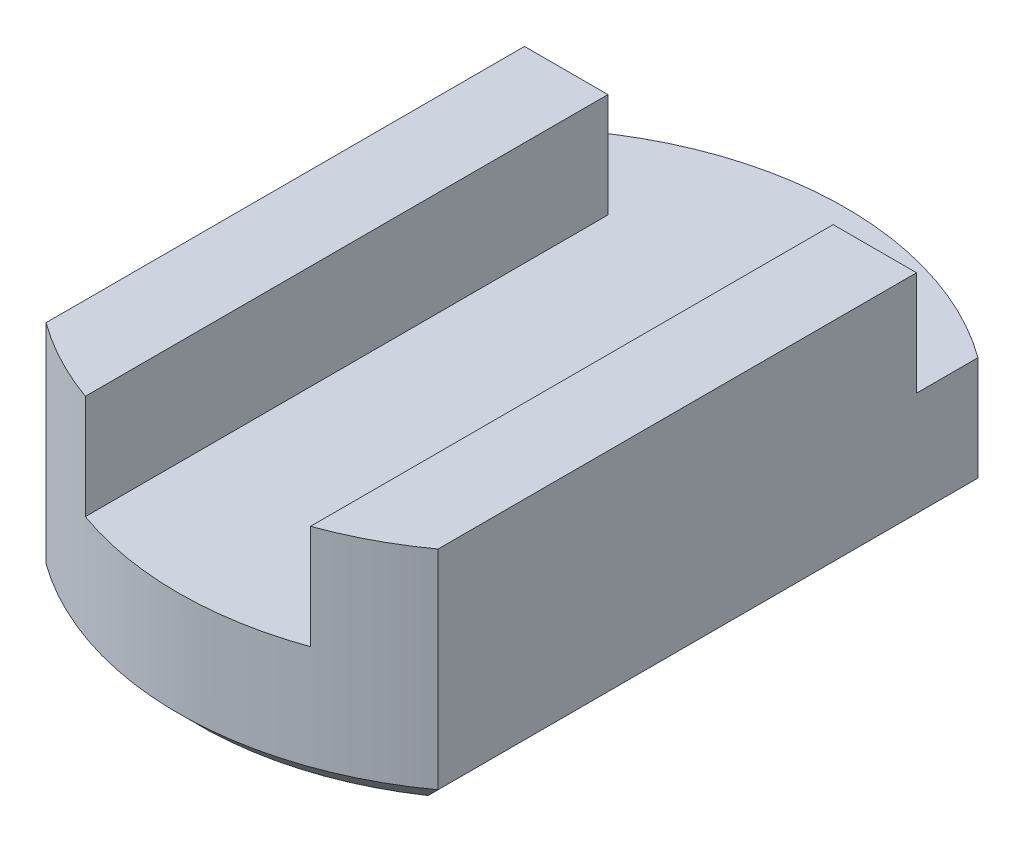
ISO-10303-21;
HEADER;
FILE_DESCRIPTION(('STEP AP214'),'2;1');
FILE_NAME('part.step','',(''),(''),'','','');
FILE_SCHEMA(('AUTOMOTIVE_DESIGN { 1 0 10303 214 1 1 1 1 }'));
ENDSEC;
DATA;
#1=APPLICATION_CONTEXT('core data for automotive mechanical design processes');
#2=APPLICATION_PROTOCOL_DEFINITION('international standard','automotive_design',2000,#1);
#3=PRODUCT_CONTEXT('',#1,'mechanical');
#4=PRODUCT('Part','Part','',(#3));
#5=PRODUCT_RELATED_PRODUCT_CATEGORY('part','',(#4));
#6=PRODUCT_DEFINITION_FORMATION('','',#4);
#7=PRODUCT_DEFINITION_CONTEXT('part definition',#1,'design');
#8=PRODUCT_DEFINITION('design','',#6,#7);
#9=PRODUCT_DEFINITION_SHAPE('','',#8);
#10=(LENGTH_UNIT() NAMED_UNIT(*) SI_UNIT(.MILLI.,.METRE.));
#11=(NAMED_UNIT(*) PLANE_ANGLE_UNIT() SI_UNIT($,.RADIAN.));
#12=(NAMED_UNIT(*) SI_UNIT($,.STERADIAN.) SOLID_ANGLE_UNIT());
#13=UNCERTAINTY_MEASURE_WITH_UNIT(LENGTH_MEASURE(1.E-05),#10,'distance_accuracy_value','');
#14=(GEOMETRIC_REPRESENTATION_CONTEXT(3) GLOBAL_UNCERTAINTY_ASSIGNED_CONTEXT((#13)) GLOBAL_UNIT_ASSIGNED_CONTEXT((#10,
#11,#12)) REPRESENTATION_CONTEXT('',''));
#15=CARTESIAN_POINT('',(0.,0.,0.));
#16=DIRECTION('',(0.,0.,1.));
#17=DIRECTION('',(1.,0.,0.));
#18=AXIS2_PLACEMENT_3D('',#15,#16,#17);
#19=CARTESIAN_POINT('',(0.,3.,0.));
#20=DIRECTION('',(0.,-1.,0.));
#21=DIRECTION('',(0.,0.,-1.));
#22=AXIS2_PLACEMENT_3D('',#19,#20,#21);
#23=CYLINDRICAL_SURFACE('',#22,8.);
#24=CARTESIAN_POINT('',(0.,3.,0.));
#25=DIRECTION('',(0.,1.,0.));
#26=DIRECTION('',(0.,0.,1.));
#27=AXIS2_PLACEMENT_3D('',#24,#25,#26);
#28=CIRCLE('',#27,8.);
#29=CARTESIAN_POINT('',(4.7,3.,-6.4737933238558));
#30=VERTEX_POINT('',#29);
#31=CARTESIAN_POINT('',(-4.7,3.,-6.47379332385581));
#32=VERTEX_POINT('',#31);
#33=EDGE_CURVE('E205',#30,#32,#28,.T.);
#34=ORIENTED_EDGE('',*,*,#33,.F.);
#35=DIRECTION('',(0.,-1.,0.));
#36=VECTOR('',#35,1.);
#37=CARTESIAN_POINT('',(4.7,3.,-6.4737933238558));
#38=LINE('',#37,#36);
#39=CARTESIAN_POINT('',(4.7,0.499999999999999,-6.4737933238558));
#40=VERTEX_POINT('',#39);
#41=EDGE_CURVE('E158',#30,#40,#38,.T.);
#42=ORIENTED_EDGE('',*,*,#41,.T.);
#43=CARTESIAN_POINT('',(0.,0.499999999999999,0.));
#44=DIRECTION('',(0.,1.,0.));
#45=DIRECTION('',(0.,0.,1.));
#46=AXIS2_PLACEMENT_3D('',#43,#44,#45);
#47=CIRCLE('',#46,8.);
#48=CARTESIAN_POINT('',(-4.7,0.499999999999999,-6.47379332385581));
#49=VERTEX_POINT('',#48);
#50=EDGE_CURVE('E242',#40,#49,#47,.T.);
#51=ORIENTED_EDGE('',*,*,#50,.T.);
#52=DIRECTION('',(0.,-1.,0.));
#53=VECTOR('',#52,1.);
#54=CARTESIAN_POINT('',(-4.7,3.,-6.47379332385581));
#55=LINE('',#54,#53);
#56=EDGE_CURVE('E209',#32,#49,#55,.T.);
#57=ORIENTED_EDGE('',*,*,#56,.F.);
#58=EDGE_LOOP('',(#34,#42,#51,#57));
#59=FACE_BOUND('',#58,.T.);
#60=ADVANCED_FACE('F43',(#59),#23,.T.);
#61=CARTESIAN_POINT('',(0.,3.,0.));
#62=DIRECTION('',(0.,1.,0.));
#63=DIRECTION('',(0.,0.,1.));
#64=AXIS2_PLACEMENT_3D('',#61,#62,#63);
#65=PLANE('',#64);
#66=DIRECTION('',(0.,0.,1.));
#67=VECTOR('',#66,1.);
#68=CARTESIAN_POINT('',(2.7,3.,-7.53060422542574));
#69=LINE('',#68,#67);
#70=CARTESIAN_POINT('',(2.7,3.,-5.));
#71=VERTEX_POINT('',#70);
#72=CARTESIAN_POINT('',(2.7,3.,7.53060422542573));
#73=VERTEX_POINT('',#72);
#74=EDGE_CURVE('E151',#71,#73,#69,.T.);
#75=ORIENTED_EDGE('',*,*,#74,.F.);
#76=DIRECTION('',(-1.,0.,0.));
#77=VECTOR('',#76,1.);
#78=CARTESIAN_POINT('',(-5.0951275734276,3.,-5.));
#79=LINE('',#78,#77);
#80=CARTESIAN_POINT('',(4.7,3.,-5.));
#81=VERTEX_POINT('',#80);
#82=EDGE_CURVE('E136',#81,#71,#79,.T.);
#83=ORIENTED_EDGE('',*,*,#82,.F.);
#84=DIRECTION('',(0.,0.,1.));
#85=VECTOR('',#84,1.);
#86=CARTESIAN_POINT('',(4.7,3.,0.));
#87=LINE('',#86,#85);
#88=EDGE_CURVE('E148',#30,#81,#87,.T.);
#89=ORIENTED_EDGE('',*,*,#88,.F.);
#90=ORIENTED_EDGE('',*,*,#33,.T.);
#91=DIRECTION('',(0.,0.,1.));
#92=VECTOR('',#91,1.);
#93=CARTESIAN_POINT('',(-4.7,3.,0.));
#94=LINE('',#93,#92);
#95=CARTESIAN_POINT('',(-4.7,3.,-5.));
#96=VERTEX_POINT('',#95);
#97=EDGE_CURVE('E161',#32,#96,#94,.T.);
#98=ORIENTED_EDGE('',*,*,#97,.T.);
#99=CARTESIAN_POINT('',(-2.7,3.,-5.));
#100=VERTEX_POINT('',#99);
#101=EDGE_CURVE('E154',#100,#96,#79,.T.);
#102=ORIENTED_EDGE('',*,*,#101,.F.);
#103=DIRECTION('',(0.,0.,-1.));
#104=VECTOR('',#103,1.);
#105=CARTESIAN_POINT('',(-2.7,3.,-7.53060422542574));
#106=LINE('',#105,#104);
#107=CARTESIAN_POINT('',(-2.7,3.,7.53060422542574));
#108=VERTEX_POINT('',#107);
#109=EDGE_CURVE('E160',#108,#100,#106,.T.);
#110=ORIENTED_EDGE('',*,*,#109,.F.);
#111=CARTESIAN_POINT('',(0.,3.,0.));
#112=DIRECTION('',(0.,1.,0.));
#113=DIRECTION('',(0.,0.,1.));
#114=AXIS2_PLACEMENT_3D('',#111,#112,#113);
#115=CIRCLE('',#114,8.);
#116=EDGE_CURVE('E202',#108,#73,#115,.T.);
#117=ORIENTED_EDGE('',*,*,#116,.T.);
#118=EDGE_LOOP('',(#75,#83,#89,#90,#98,#102,#110,#117));
#119=FACE_BOUND('',#118,.T.);
#120=ADVANCED_FACE('F147',(#119),#65,.T.);
#121=CARTESIAN_POINT('',(-4.7,3.,0.));
#122=DIRECTION('',(1.,0.,0.));
#123=DIRECTION('',(0.,0.,-1.));
#124=AXIS2_PLACEMENT_3D('',#121,#122,#123);
#125=PLANE('',#124);
#126=DIRECTION('',(0.,0.,1.));
#127=VECTOR('',#126,1.);
#128=CARTESIAN_POINT('',(-4.7,5.5,-6.4737933238558));
#129=LINE('',#128,#127);
#130=CARTESIAN_POINT('',(-4.7,5.5,-5.));
#131=VERTEX_POINT('',#130);
#132=CARTESIAN_POINT('',(-4.7,5.5,6.4737933238558));
#133=VERTEX_POINT('',#132);
#134=EDGE_CURVE('E178',#131,#133,#129,.T.);
#135=ORIENTED_EDGE('',*,*,#134,.F.);
#136=DIRECTION('',(0.,-1.,0.));
#137=VECTOR('',#136,1.);
#138=CARTESIAN_POINT('',(-4.7,3.,-5.));
#139=LINE('',#138,#137);
#140=EDGE_CURVE('E68',#131,#96,#139,.T.);
#141=ORIENTED_EDGE('',*,*,#140,.T.);
#142=ORIENTED_EDGE('',*,*,#97,.F.);
#143=ORIENTED_EDGE('',*,*,#56,.T.);
#144=DIRECTION('',(0.,0.,1.));
#145=VECTOR('',#144,1.);
#146=CARTESIAN_POINT('',(-4.7,0.499999999999999,0.));
#147=LINE('',#146,#145);
#148=CARTESIAN_POINT('',(-4.7,0.499999999999999,6.47379332385581));
#149=VERTEX_POINT('',#148);
#150=EDGE_CURVE('E54',#49,#149,#147,.T.);
#151=ORIENTED_EDGE('',*,*,#150,.T.);
#152=DIRECTION('',(0.,-1.,0.));
#153=VECTOR('',#152,1.);
#154=CARTESIAN_POINT('',(-4.7,3.,6.47379332385581));
#155=LINE('',#154,#153);
#156=EDGE_CURVE('E218',#133,#149,#155,.T.);
#157=ORIENTED_EDGE('',*,*,#156,.F.);
#158=EDGE_LOOP('',(#135,#141,#142,#143,#151,#157));
#159=FACE_BOUND('',#158,.T.);
#160=ADVANCED_FACE('F332',(#159),#125,.F.);
#161=CARTESIAN_POINT('',(0.,3.,0.));
#162=DIRECTION('',(0.,-1.,0.));
#163=DIRECTION('',(0.,0.,-1.));
#164=AXIS2_PLACEMENT_3D('',#161,#162,#163);
#165=CYLINDRICAL_SURFACE('',#164,8.);
#166=ORIENTED_EDGE('',*,*,#156,.T.);
#167=CARTESIAN_POINT('',(0.,0.499999999999999,0.));
#168=DIRECTION('',(0.,1.,0.));
#169=DIRECTION('',(0.,0.,1.));
#170=AXIS2_PLACEMENT_3D('',#167,#168,#169);
#171=CIRCLE('',#170,8.);
#172=CARTESIAN_POINT('',(4.7,0.499999999999999,6.4737933238558));
#173=VERTEX_POINT('',#172);
#174=EDGE_CURVE('E222',#149,#173,#171,.T.);
#175=ORIENTED_EDGE('',*,*,#174,.T.);
#176=DIRECTION('',(0.,-1.,0.));
#177=VECTOR('',#176,1.);
#178=CARTESIAN_POINT('',(4.7,3.,6.4737933238558));
#179=LINE('',#178,#177);
#180=CARTESIAN_POINT('',(4.7,5.5,6.4737933238558));
#181=VERTEX_POINT('',#180);
#182=EDGE_CURVE('E214',#181,#173,#179,.T.);
#183=ORIENTED_EDGE('',*,*,#182,.F.);
#184=CARTESIAN_POINT('',(0.,5.5,0.));
#185=DIRECTION('',(0.,1.,0.));
#186=DIRECTION('',(0.,0.,1.));
#187=AXIS2_PLACEMENT_3D('',#184,#185,#186);
#188=CIRCLE('',#187,8.);
#189=CARTESIAN_POINT('',(2.7,5.5,7.53060422542573));
#190=VERTEX_POINT('',#189);
#191=EDGE_CURVE('E185',#190,#181,#188,.T.);
#192=ORIENTED_EDGE('',*,*,#191,.F.);
#193=DIRECTION('',(0.,-1.,0.));
#194=VECTOR('',#193,1.);
#195=CARTESIAN_POINT('',(2.7,5.5,7.53060422542573));
#196=LINE('',#195,#194);
#197=EDGE_CURVE('E195',#190,#73,#196,.T.);
#198=ORIENTED_EDGE('',*,*,#197,.T.);
#199=ORIENTED_EDGE('',*,*,#116,.F.);
#200=DIRECTION('',(0.,-1.,0.));
#201=VECTOR('',#200,1.);
#202=CARTESIAN_POINT('',(-2.7,5.5,7.53060422542573));
#203=LINE('',#202,#201);
#204=CARTESIAN_POINT('',(-2.7,5.5,7.53060422542573));
#205=VERTEX_POINT('',#204);
#206=EDGE_CURVE('E180',#205,#108,#203,.T.);
#207=ORIENTED_EDGE('',*,*,#206,.F.);
#208=CARTESIAN_POINT('',(0.,5.5,0.));
#209=DIRECTION('',(0.,1.,0.));
#210=DIRECTION('',(0.,0.,1.));
#211=AXIS2_PLACEMENT_3D('',#208,#209,#210);
#212=CIRCLE('',#211,8.);
#213=EDGE_CURVE('E166',#133,#205,#212,.T.);
#214=ORIENTED_EDGE('',*,*,#213,.F.);
#215=EDGE_LOOP('',(#166,#175,#183,#192,#198,#199,#207,#214));
#216=FACE_BOUND('',#215,.T.);
#217=ADVANCED_FACE('F313',(#216),#165,.T.);
#218=CARTESIAN_POINT('',(4.7,3.,0.));
#219=DIRECTION('',(1.,0.,0.));
#220=DIRECTION('',(0.,0.,-1.));
#221=AXIS2_PLACEMENT_3D('',#218,#219,#220);
#222=PLANE('',#221);
#223=DIRECTION('',(0.,-1.,0.));
#224=VECTOR('',#223,1.);
#225=CARTESIAN_POINT('',(4.7,3.,-5.));
#226=LINE('',#225,#224);
#227=CARTESIAN_POINT('',(4.7,5.5,-5.));
#228=VERTEX_POINT('',#227);
#229=EDGE_CURVE('E133',#228,#81,#226,.T.);
#230=ORIENTED_EDGE('',*,*,#229,.F.);
#231=DIRECTION('',(0.,0.,-1.));
#232=VECTOR('',#231,1.);
#233=CARTESIAN_POINT('',(4.7,5.5,-6.4737933238558));
#234=LINE('',#233,#232);
#235=EDGE_CURVE('E189',#181,#228,#234,.T.);
#236=ORIENTED_EDGE('',*,*,#235,.F.);
#237=ORIENTED_EDGE('',*,*,#182,.T.);
#238=DIRECTION('',(0.,0.,-1.));
#239=VECTOR('',#238,1.);
#240=CARTESIAN_POINT('',(4.7,0.499999999999999,-6.4737933238558));
#241=LINE('',#240,#239);
#242=EDGE_CURVE('E239',#173,#40,#241,.T.);
#243=ORIENTED_EDGE('',*,*,#242,.T.);
#244=ORIENTED_EDGE('',*,*,#41,.F.);
#245=ORIENTED_EDGE('',*,*,#88,.T.);
#246=EDGE_LOOP('',(#230,#236,#237,#243,#244,#245));
#247=FACE_BOUND('',#246,.T.);
#248=ADVANCED_FACE('F156',(#247),#222,.T.);
#249=CARTESIAN_POINT('',(0.,0.,0.));
#250=DIRECTION('',(0.,1.,0.));
#251=DIRECTION('',(0.,0.,1.));
#252=AXIS2_PLACEMENT_3D('',#249,#250,#251);
#253=PLANE('',#252);
#254=DIRECTION('',(0.,0.,1.));
#255=VECTOR('',#254,1.);
#256=CARTESIAN_POINT('',(4.2,0.,6.4737933238558));
#257=LINE('',#256,#255);
#258=CARTESIAN_POINT('',(4.19999999999999,0.,-6.2136945531624));
#259=VERTEX_POINT('',#258);
#260=CARTESIAN_POINT('',(4.2,0.,6.2136945531624));
#261=VERTEX_POINT('',#260);
#262=EDGE_CURVE('E232',#259,#261,#257,.T.);
#263=ORIENTED_EDGE('',*,*,#262,.T.);
#264=CARTESIAN_POINT('',(0.,0.,0.));
#265=DIRECTION('',(0.,1.,0.));
#266=DIRECTION('',(0.,0.,1.));
#267=AXIS2_PLACEMENT_3D('',#264,#265,#266);
#268=CIRCLE('',#267,7.5);
#269=CARTESIAN_POINT('',(-4.2,0.,6.2136945531624));
#270=VERTEX_POINT('',#269);
#271=EDGE_CURVE('E235',#261,#270,#268,.F.);
#272=ORIENTED_EDGE('',*,*,#271,.T.);
#273=DIRECTION('',(0.,0.,-1.));
#274=VECTOR('',#273,1.);
#275=CARTESIAN_POINT('',(-4.2,0.,0.));
#276=LINE('',#275,#274);
#277=CARTESIAN_POINT('',(-4.2,0.,-6.2136945531624));
#278=VERTEX_POINT('',#277);
#279=EDGE_CURVE('E226',#270,#278,#276,.T.);
#280=ORIENTED_EDGE('',*,*,#279,.T.);
#281=CARTESIAN_POINT('',(0.,0.,0.));
#282=DIRECTION('',(0.,1.,0.));
#283=DIRECTION('',(0.,0.,1.));
#284=AXIS2_PLACEMENT_3D('',#281,#282,#283);
#285=CIRCLE('',#284,7.5);
#286=EDGE_CURVE('E229',#278,#259,#285,.F.);
#287=ORIENTED_EDGE('',*,*,#286,.T.);
#288=EDGE_LOOP('',(#263,#272,#280,#287));
#289=FACE_BOUND('',#288,.T.);
#290=ADVANCED_FACE('F310',(#289),#253,.F.);
#291=CARTESIAN_POINT('',(0.,0.499999999999999,0.));
#292=DIRECTION('',(0.,1.,0.));
#293=DIRECTION('',(0.,0.,1.));
#294=AXIS2_PLACEMENT_3D('',#291,#292,#293);
#295=CONICAL_SURFACE('',#294,8.,0.785398163397452);
#296=CARTESIAN_POINT('',(4.7,0.499999999999999,-6.4737933238558));
#297=CARTESIAN_POINT('',(4.61646311366548,0.416463113665481,-6.43122625702058));
#298=CARTESIAN_POINT('',(4.53302801862027,0.333028018620272,-6.38826783389633));
#299=CARTESIAN_POINT('',(4.36636135180873,0.166361351808735,-6.30156824422218));
#300=CARTESIAN_POINT('',(4.28312978018728,0.0831297801872757,-6.25782707711531));
#301=CARTESIAN_POINT('',(4.19999999999999,0.,-6.21369455316243));
#302=B_SPLINE_CURVE_WITH_KNOTS('',3,(#296,#297,#298,#299,#300,#301),.UNSPECIFIED.,.F.,.F.,(4,2,
4),(0.,0.376715153119115,0.75343057430764),.UNSPECIFIED.);
#303=EDGE_CURVE('E289',#259,#40,#302,.F.);
#304=ORIENTED_EDGE('',*,*,#303,.F.);
#305=ORIENTED_EDGE('',*,*,#286,.F.);
#306=CARTESIAN_POINT('',(-4.7,0.499999999999999,-6.47379332385581));
#307=CARTESIAN_POINT('',(-4.61646311366548,0.41646311366548,-6.43122625702058));
#308=CARTESIAN_POINT('',(-4.53302801862027,0.333028018620271,-6.38826783389633));
#309=CARTESIAN_POINT('',(-4.36636135180873,0.166361351808732,-6.30156824422218));
#310=CARTESIAN_POINT('',(-4.28312978018727,0.0831297801872721,-6.2578270771153));
#311=CARTESIAN_POINT('',(-4.19999999999999,0.,-6.21369455316243));
#312=B_SPLINE_CURVE_WITH_KNOTS('',3,(#306,#307,#308,#309,#310,#311),.UNSPECIFIED.,.F.,.F.,(4,2,
4),(0.,0.376715153119119,0.753430574307647),.UNSPECIFIED.);
#313=EDGE_CURVE('E206',#49,#278,#312,.T.);
#314=ORIENTED_EDGE('',*,*,#313,.F.);
#315=ORIENTED_EDGE('',*,*,#50,.F.);
#316=EDGE_LOOP('',(#304,#305,#314,#315));
#317=FACE_BOUND('',#316,.T.);
#318=ADVANCED_FACE('F46',(#317),#295,.T.);
#319=CARTESIAN_POINT('',(-4.7,0.499999999999999,0.));
#320=DIRECTION('',(0.707106781186545,0.70710678118655,0.));
#321=DIRECTION('',(0.,0.,1.));
#322=AXIS2_PLACEMENT_3D('',#319,#320,#321);
#323=PLANE('',#322);
#324=ORIENTED_EDGE('',*,*,#313,.T.);
#325=ORIENTED_EDGE('',*,*,#279,.F.);
#326=CARTESIAN_POINT('',(-4.19999999999999,0.,6.2136945531624));
#327=CARTESIAN_POINT('',(-4.28312978018727,0.0831297801872788,6.25782707711528));
#328=CARTESIAN_POINT('',(-4.36636135180873,0.166361351808735,6.30156824422216));
#329=CARTESIAN_POINT('',(-4.53302801862027,0.333028018620267,6.38826783389634));
#330=CARTESIAN_POINT('',(-4.61646311366547,0.416463113665473,6.43122625702061));
#331=CARTESIAN_POINT('',(-4.69999999999999,0.499999999999988,6.47379332385585));
#332=B_SPLINE_CURVE_WITH_KNOTS('',3,(#326,#327,#328,#329,#330,#331),.UNSPECIFIED.,.F.,.F.,(4,2,
4),(0.,0.376715421188529,0.753430574307647),.UNSPECIFIED.);
#333=EDGE_CURVE('E256',#149,#270,#332,.F.);
#334=ORIENTED_EDGE('',*,*,#333,.F.);
#335=ORIENTED_EDGE('',*,*,#150,.F.);
#336=EDGE_LOOP('',(#324,#325,#334,#335));
#337=FACE_BOUND('',#336,.T.);
#338=ADVANCED_FACE('F275',(#337),#323,.F.);
#339=CARTESIAN_POINT('',(4.2,0.,0.));
#340=DIRECTION('',(0.707106781186545,-0.70710678118655,0.));
#341=DIRECTION('',(0.,0.,-1.));
#342=AXIS2_PLACEMENT_3D('',#339,#340,#341);
#343=PLANE('',#342);
#344=ORIENTED_EDGE('',*,*,#303,.T.);
#345=ORIENTED_EDGE('',*,*,#242,.F.);
#346=CARTESIAN_POINT('',(4.7,0.499999999999999,6.4737933238558));
#347=CARTESIAN_POINT('',(4.61646311366548,0.41646311366548,6.43122625702058));
#348=CARTESIAN_POINT('',(4.53302801862027,0.33302801862027,6.38826783389633));
#349=CARTESIAN_POINT('',(4.36636135180873,0.166361351808732,6.30156824422218));
#350=CARTESIAN_POINT('',(4.28312978018727,0.0831297801872719,6.2578270771153));
#351=CARTESIAN_POINT('',(4.19999999999999,0.,6.21369455316243));
#352=B_SPLINE_CURVE_WITH_KNOTS('',3,(#346,#347,#348,#349,#350,#351),.UNSPECIFIED.,.F.,.F.,(4,2,
4),(0.,0.376715153119118,0.753430574307646),.UNSPECIFIED.);
#353=EDGE_CURVE('E201',#261,#173,#352,.F.);
#354=ORIENTED_EDGE('',*,*,#353,.F.);
#355=ORIENTED_EDGE('',*,*,#262,.F.);
#356=EDGE_LOOP('',(#344,#345,#354,#355));
#357=FACE_BOUND('',#356,.T.);
#358=ADVANCED_FACE('F263',(#357),#343,.T.);
#359=CARTESIAN_POINT('',(0.,0.499999999999999,0.));
#360=DIRECTION('',(0.,1.,0.));
#361=DIRECTION('',(0.,0.,1.));
#362=AXIS2_PLACEMENT_3D('',#359,#360,#361);
#363=CONICAL_SURFACE('',#362,8.,0.785398163397452);
#364=ORIENTED_EDGE('',*,*,#333,.T.);
#365=ORIENTED_EDGE('',*,*,#271,.F.);
#366=ORIENTED_EDGE('',*,*,#353,.T.);
#367=ORIENTED_EDGE('',*,*,#174,.F.);
#368=EDGE_LOOP('',(#364,#365,#366,#367));
#369=FACE_BOUND('',#368,.T.);
#370=ADVANCED_FACE('F267',(#369),#363,.T.);
#371=CARTESIAN_POINT('',(2.7,5.5,-7.53060422542574));
#372=DIRECTION('',(1.,0.,0.));
#373=DIRECTION('',(0.,0.,-1.));
#374=AXIS2_PLACEMENT_3D('',#371,#372,#373);
#375=PLANE('',#374);
#376=DIRECTION('',(0.,0.,1.));
#377=VECTOR('',#376,1.);
#378=CARTESIAN_POINT('',(2.7,5.5,-7.53060422542574));
#379=LINE('',#378,#377);
#380=CARTESIAN_POINT('',(2.7,5.5,-5.));
#381=VERTEX_POINT('',#380);
#382=EDGE_CURVE('E192',#381,#190,#379,.T.);
#383=ORIENTED_EDGE('',*,*,#382,.F.);
#384=DIRECTION('',(0.,-1.,0.));
#385=VECTOR('',#384,1.);
#386=CARTESIAN_POINT('',(2.7,5.5,-5.));
#387=LINE('',#386,#385);
#388=EDGE_CURVE('E61',#381,#71,#387,.T.);
#389=ORIENTED_EDGE('',*,*,#388,.T.);
#390=ORIENTED_EDGE('',*,*,#74,.T.);
#391=ORIENTED_EDGE('',*,*,#197,.F.);
#392=EDGE_LOOP('',(#383,#389,#390,#391));
#393=FACE_BOUND('',#392,.T.);
#394=ADVANCED_FACE('F273',(#393),#375,.F.);
#395=CARTESIAN_POINT('',(0.,5.5,0.));
#396=DIRECTION('',(0.,1.,0.));
#397=DIRECTION('',(0.,0.,1.));
#398=AXIS2_PLACEMENT_3D('',#395,#396,#397);
#399=PLANE('',#398);
#400=DIRECTION('',(1.,0.,0.));
#401=VECTOR('',#400,1.);
#402=CARTESIAN_POINT('',(-5.0951275734276,5.5,-5.));
#403=LINE('',#402,#401);
#404=EDGE_CURVE('E137',#381,#228,#403,.T.);
#405=ORIENTED_EDGE('',*,*,#404,.F.);
#406=ORIENTED_EDGE('',*,*,#382,.T.);
#407=ORIENTED_EDGE('',*,*,#191,.T.);
#408=ORIENTED_EDGE('',*,*,#235,.T.);
#409=EDGE_LOOP('',(#405,#406,#407,#408));
#410=FACE_BOUND('',#409,.T.);
#411=ADVANCED_FACE('F318',(#410),#399,.T.);
#412=CARTESIAN_POINT('',(-2.7,5.5,-7.53060422542574));
#413=DIRECTION('',(-1.,0.,0.));
#414=DIRECTION('',(0.,0.,1.));
#415=AXIS2_PLACEMENT_3D('',#412,#413,#414);
#416=PLANE('',#415);
#417=ORIENTED_EDGE('',*,*,#109,.T.);
#418=DIRECTION('',(0.,1.,0.));
#419=VECTOR('',#418,1.);
#420=CARTESIAN_POINT('',(-2.7,5.5,-5.));
#421=LINE('',#420,#419);
#422=CARTESIAN_POINT('',(-2.7,5.5,-5.));
#423=VERTEX_POINT('',#422);
#424=EDGE_CURVE('E153',#100,#423,#421,.T.);
#425=ORIENTED_EDGE('',*,*,#424,.T.);
#426=DIRECTION('',(0.,0.,-1.));
#427=VECTOR('',#426,1.);
#428=CARTESIAN_POINT('',(-2.7,5.5,-7.53060422542574));
#429=LINE('',#428,#427);
#430=EDGE_CURVE('E174',#205,#423,#429,.T.);
#431=ORIENTED_EDGE('',*,*,#430,.F.);
#432=ORIENTED_EDGE('',*,*,#206,.T.);
#433=EDGE_LOOP('',(#417,#425,#431,#432));
#434=FACE_BOUND('',#433,.T.);
#435=ADVANCED_FACE('F327',(#434),#416,.F.);
#436=CARTESIAN_POINT('',(0.,5.5,0.));
#437=DIRECTION('',(0.,1.,0.));
#438=DIRECTION('',(0.,0.,1.));
#439=AXIS2_PLACEMENT_3D('',#436,#437,#438);
#440=PLANE('',#439);
#441=DIRECTION('',(1.,0.,0.));
#442=VECTOR('',#441,1.);
#443=CARTESIAN_POINT('',(0.,5.5,-5.));
#444=LINE('',#443,#442);
#445=EDGE_CURVE('E11',#131,#423,#444,.T.);
#446=ORIENTED_EDGE('',*,*,#445,.F.);
#447=ORIENTED_EDGE('',*,*,#134,.T.);
#448=ORIENTED_EDGE('',*,*,#213,.T.);
#449=ORIENTED_EDGE('',*,*,#430,.T.);
#450=EDGE_LOOP('',(#446,#447,#448,#449));
#451=FACE_BOUND('',#450,.T.);
#452=ADVANCED_FACE('F329',(#451),#440,.T.);
#453=CARTESIAN_POINT('',(-5.0951275734276,-8.82545136381733,-5.));
#454=DIRECTION('',(0.,0.,1.));
#455=DIRECTION('',(1.,0.,0.));
#456=AXIS2_PLACEMENT_3D('',#453,#454,#455);
#457=PLANE('',#456);
#458=ORIENTED_EDGE('',*,*,#445,.T.);
#459=ORIENTED_EDGE('',*,*,#424,.F.);
#460=ORIENTED_EDGE('',*,*,#101,.T.);
#461=ORIENTED_EDGE('',*,*,#140,.F.);
#462=EDGE_LOOP('',(#458,#459,#460,#461));
#463=FACE_BOUND('',#462,.T.);
#464=ADVANCED_FACE('F420',(#463),#457,.F.);
#465=ORIENTED_EDGE('',*,*,#229,.T.);
#466=ORIENTED_EDGE('',*,*,#82,.T.);
#467=ORIENTED_EDGE('',*,*,#388,.F.);
#468=ORIENTED_EDGE('',*,*,#404,.T.);
#469=EDGE_LOOP('',(#465,#466,#467,#468));
#470=FACE_BOUND('',#469,.T.);
#471=ADVANCED_FACE('F135',(#470),#457,.F.);
#472=CLOSED_SHELL('',(#60,#120,#160,#217,#248,#290,#318,#338,#358,#370,#394,#411,#435,#452,#464,#471));
#473=MANIFOLD_SOLID_BREP('B2',#472);
#474=ADVANCED_BREP_SHAPE_REPRESENTATION('',(#18,#473),#14);
#475=SHAPE_DEFINITION_REPRESENTATION(#9,#474);
ENDSEC;
END-ISO-10303-21;
